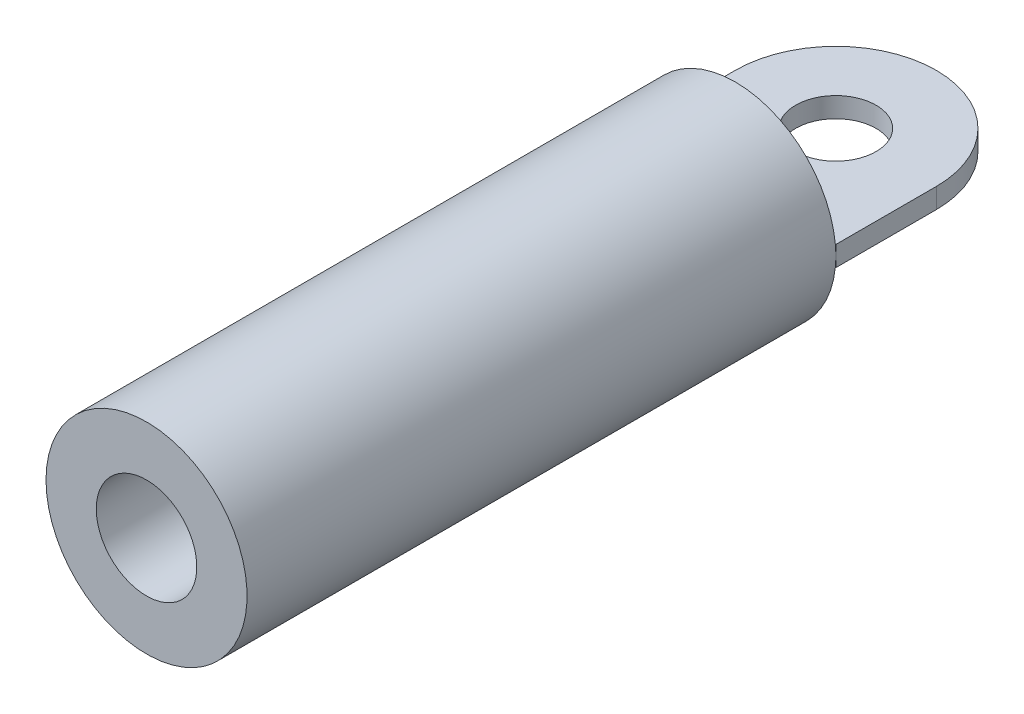
ISO-10303-21;
HEADER;
FILE_DESCRIPTION(('STEP AP214'),'2;1');
FILE_NAME('part.step','',(''),(''),'','','');
FILE_SCHEMA(('AUTOMOTIVE_DESIGN { 1 0 10303 214 1 1 1 1 }'));
ENDSEC;
DATA;
#1=APPLICATION_CONTEXT('core data for automotive mechanical design processes');
#2=APPLICATION_PROTOCOL_DEFINITION('international standard','automotive_design',2000,#1);
#3=PRODUCT_CONTEXT('',#1,'mechanical');
#4=PRODUCT('Part','Part','',(#3));
#5=PRODUCT_RELATED_PRODUCT_CATEGORY('part','',(#4));
#6=PRODUCT_DEFINITION_FORMATION('','',#4);
#7=PRODUCT_DEFINITION_CONTEXT('part definition',#1,'design');
#8=PRODUCT_DEFINITION('design','',#6,#7);
#9=PRODUCT_DEFINITION_SHAPE('','',#8);
#10=(LENGTH_UNIT() NAMED_UNIT(*) SI_UNIT(.MILLI.,.METRE.));
#11=(NAMED_UNIT(*) PLANE_ANGLE_UNIT() SI_UNIT($,.RADIAN.));
#12=(NAMED_UNIT(*) SI_UNIT($,.STERADIAN.) SOLID_ANGLE_UNIT());
#13=UNCERTAINTY_MEASURE_WITH_UNIT(LENGTH_MEASURE(1.E-05),#10,'distance_accuracy_value','');
#14=(GEOMETRIC_REPRESENTATION_CONTEXT(3) GLOBAL_UNCERTAINTY_ASSIGNED_CONTEXT((#13)) GLOBAL_UNIT_ASSIGNED_CONTEXT((#10,
#11,#12)) REPRESENTATION_CONTEXT('',''));
#15=CARTESIAN_POINT('',(0.,0.,0.));
#16=DIRECTION('',(0.,0.,1.));
#17=DIRECTION('',(1.,0.,0.));
#18=AXIS2_PLACEMENT_3D('',#15,#16,#17);
#19=CARTESIAN_POINT('',(0.,0.,3.175));
#20=DIRECTION('',(0.,0.,-1.));
#21=DIRECTION('',(-1.,0.,0.));
#22=AXIS2_PLACEMENT_3D('',#19,#20,#21);
#23=PLANE('',#22);
#24=CARTESIAN_POINT('',(0.,0.,3.175));
#25=DIRECTION('',(0.,0.,-1.));
#26=DIRECTION('',(-1.,0.,0.));
#27=AXIS2_PLACEMENT_3D('',#24,#25,#26);
#28=CIRCLE('',#27,3.175);
#29=CARTESIAN_POINT('',(3.15908511281352,-0.3175,3.175));
#30=VERTEX_POINT('',#29);
#31=CARTESIAN_POINT('',(-3.15908511281352,-0.3175,3.175));
#32=VERTEX_POINT('',#31);
#33=EDGE_CURVE('E211',#30,#32,#28,.T.);
#34=ORIENTED_EDGE('',*,*,#33,.T.);
#35=DIRECTION('',(1.,0.,0.));
#36=VECTOR('',#35,1.);
#37=CARTESIAN_POINT('',(0.,-0.3175,3.175));
#38=LINE('',#37,#36);
#39=CARTESIAN_POINT('',(-1.55542598666732,-0.3175,3.175));
#40=VERTEX_POINT('',#39);
#41=EDGE_CURVE('E231',#32,#40,#38,.T.);
#42=ORIENTED_EDGE('',*,*,#41,.T.);
#43=CARTESIAN_POINT('',(0.,0.,3.175));
#44=DIRECTION('',(0.,0.,-1.));
#45=DIRECTION('',(-1.,0.,0.));
#46=AXIS2_PLACEMENT_3D('',#43,#44,#45);
#47=CIRCLE('',#46,1.5875);
#48=CARTESIAN_POINT('',(1.55542598666732,-0.3175,3.175));
#49=VERTEX_POINT('',#48);
#50=EDGE_CURVE('E208',#49,#40,#47,.T.);
#51=ORIENTED_EDGE('',*,*,#50,.F.);
#52=EDGE_CURVE('E164',#49,#30,#38,.T.);
#53=ORIENTED_EDGE('',*,*,#52,.T.);
#54=EDGE_LOOP('',(#34,#42,#51,#53));
#55=FACE_BOUND('',#54,.T.);
#56=ADVANCED_FACE('F41',(#55),#23,.T.);
#57=CARTESIAN_POINT('',(0.,0.,0.));
#58=DIRECTION('',(0.,0.,-1.));
#59=DIRECTION('',(-1.,0.,0.));
#60=AXIS2_PLACEMENT_3D('',#57,#58,#59);
#61=CYLINDRICAL_SURFACE('',#60,1.5875);
#62=CARTESIAN_POINT('',(-1.55542598666732,0.3175,3.175));
#63=VERTEX_POINT('',#62);
#64=CARTESIAN_POINT('',(1.55542598666732,0.3175,3.175));
#65=VERTEX_POINT('',#64);
#66=EDGE_CURVE('E45',#63,#65,#47,.T.);
#67=ORIENTED_EDGE('',*,*,#66,.T.);
#68=EDGE_CURVE('E481',#65,#49,#47,.T.);
#69=ORIENTED_EDGE('',*,*,#68,.T.);
#70=ORIENTED_EDGE('',*,*,#50,.T.);
#71=EDGE_CURVE('E199',#40,#63,#47,.T.);
#72=ORIENTED_EDGE('',*,*,#71,.T.);
#73=EDGE_LOOP('',(#67,#69,#70,#72));
#74=FACE_BOUND('',#73,.T.);
#75=CARTESIAN_POINT('',(0.,0.,21.769090574));
#76=DIRECTION('',(0.,0.,-1.));
#77=DIRECTION('',(-1.,0.,0.));
#78=AXIS2_PLACEMENT_3D('',#75,#76,#77);
#79=CIRCLE('',#78,1.5875);
#80=CARTESIAN_POINT('',(-1.5875,0.,21.769090574));
#81=VERTEX_POINT('',#80);
#82=EDGE_CURVE('E182',#81,#81,#79,.T.);
#83=ORIENTED_EDGE('',*,*,#82,.F.);
#84=EDGE_LOOP('',(#83));
#85=FACE_BOUND('',#84,.T.);
#86=ADVANCED_FACE('F43',(#74,#85),#61,.F.);
#87=DIRECTION('',(1.,0.,0.));
#88=VECTOR('',#87,1.);
#89=CARTESIAN_POINT('',(0.,0.3175,3.175));
#90=LINE('',#89,#88);
#91=CARTESIAN_POINT('',(-3.15908511281352,0.3175,3.175));
#92=VERTEX_POINT('',#91);
#93=EDGE_CURVE('E11',#92,#63,#90,.T.);
#94=ORIENTED_EDGE('',*,*,#93,.F.);
#95=CARTESIAN_POINT('',(3.15908511281352,0.3175,3.175));
#96=VERTEX_POINT('',#95);
#97=EDGE_CURVE('E200',#92,#96,#28,.T.);
#98=ORIENTED_EDGE('',*,*,#97,.T.);
#99=EDGE_CURVE('E51',#65,#96,#90,.T.);
#100=ORIENTED_EDGE('',*,*,#99,.F.);
#101=ORIENTED_EDGE('',*,*,#66,.F.);
#102=EDGE_LOOP('',(#94,#98,#100,#101));
#103=FACE_BOUND('',#102,.T.);
#104=ADVANCED_FACE('F236',(#103),#23,.T.);
#105=CARTESIAN_POINT('',(0.,0.,0.));
#106=DIRECTION('',(0.,0.,-1.));
#107=DIRECTION('',(-1.,0.,0.));
#108=AXIS2_PLACEMENT_3D('',#105,#106,#107);
#109=CYLINDRICAL_SURFACE('',#108,3.175);
#110=CARTESIAN_POINT('',(0.,0.,21.769090574));
#111=DIRECTION('',(0.,0.,-1.));
#112=DIRECTION('',(-1.,0.,0.));
#113=AXIS2_PLACEMENT_3D('',#110,#111,#112);
#114=CIRCLE('',#113,3.175);
#115=CARTESIAN_POINT('',(-3.175,0.,21.769090574));
#116=VERTEX_POINT('',#115);
#117=EDGE_CURVE('E193',#116,#116,#114,.T.);
#118=ORIENTED_EDGE('',*,*,#117,.T.);
#119=EDGE_LOOP('',(#118));
#120=FACE_BOUND('',#119,.T.);
#121=CARTESIAN_POINT('',(-3.175,0.,3.175));
#122=VERTEX_POINT('',#121);
#123=EDGE_CURVE('E197',#122,#92,#28,.T.);
#124=ORIENTED_EDGE('',*,*,#123,.F.);
#125=EDGE_CURVE('E196',#32,#122,#28,.T.);
#126=ORIENTED_EDGE('',*,*,#125,.F.);
#127=ORIENTED_EDGE('',*,*,#33,.F.);
#128=CARTESIAN_POINT('',(3.175,0.,3.175));
#129=VERTEX_POINT('',#128);
#130=EDGE_CURVE('E216',#129,#30,#28,.T.);
#131=ORIENTED_EDGE('',*,*,#130,.F.);
#132=EDGE_CURVE('E132',#96,#129,#28,.T.);
#133=ORIENTED_EDGE('',*,*,#132,.F.);
#134=ORIENTED_EDGE('',*,*,#97,.F.);
#135=EDGE_LOOP('',(#124,#126,#127,#131,#133,#134));
#136=FACE_BOUND('',#135,.T.);
#137=ADVANCED_FACE('F232',(#120,#136),#109,.T.);
#138=CARTESIAN_POINT('',(0.,0.,21.769090574));
#139=DIRECTION('',(0.,0.,1.));
#140=DIRECTION('',(1.,0.,0.));
#141=AXIS2_PLACEMENT_3D('',#138,#139,#140);
#142=PLANE('',#141);
#143=ORIENTED_EDGE('',*,*,#82,.T.);
#144=EDGE_LOOP('',(#143));
#145=FACE_BOUND('',#144,.T.);
#146=ORIENTED_EDGE('',*,*,#117,.F.);
#147=EDGE_LOOP('',(#146));
#148=FACE_BOUND('',#147,.T.);
#149=ADVANCED_FACE('F259',(#145,#148),#142,.T.);
#150=CARTESIAN_POINT('',(0.,-0.3175,3.175));
#151=DIRECTION('',(0.,0.,1.));
#152=DIRECTION('',(1.,0.,0.));
#153=AXIS2_PLACEMENT_3D('',#150,#151,#152);
#154=PLANE('',#153);
#155=CARTESIAN_POINT('',(3.175,0.3175,3.175));
#156=VERTEX_POINT('',#155);
#157=EDGE_CURVE('E115',#96,#156,#90,.T.);
#158=ORIENTED_EDGE('',*,*,#157,.F.);
#159=ORIENTED_EDGE('',*,*,#132,.T.);
#160=DIRECTION('',(0.,1.,0.));
#161=VECTOR('',#160,1.);
#162=CARTESIAN_POINT('',(3.175,-0.3175,3.175));
#163=LINE('',#162,#161);
#164=EDGE_CURVE('E130',#129,#156,#163,.T.);
#165=ORIENTED_EDGE('',*,*,#164,.T.);
#166=EDGE_LOOP('',(#158,#159,#165));
#167=FACE_BOUND('',#166,.T.);
#168=ADVANCED_FACE('F131',(#167),#154,.T.);
#169=DIRECTION('',(0.,1.,0.));
#170=VECTOR('',#169,1.);
#171=CARTESIAN_POINT('',(-3.175,-0.3175,3.175));
#172=LINE('',#171,#170);
#173=CARTESIAN_POINT('',(-3.175,0.3175,3.175));
#174=VERTEX_POINT('',#173);
#175=EDGE_CURVE('E183',#122,#174,#172,.T.);
#176=ORIENTED_EDGE('',*,*,#175,.F.);
#177=ORIENTED_EDGE('',*,*,#123,.T.);
#178=EDGE_CURVE('E128',#174,#92,#90,.T.);
#179=ORIENTED_EDGE('',*,*,#178,.F.);
#180=EDGE_LOOP('',(#176,#177,#179));
#181=FACE_BOUND('',#180,.T.);
#182=ADVANCED_FACE('F252',(#181),#154,.T.);
#183=ORIENTED_EDGE('',*,*,#68,.F.);
#184=EDGE_CURVE('E53',#63,#65,#90,.T.);
#185=ORIENTED_EDGE('',*,*,#184,.F.);
#186=ORIENTED_EDGE('',*,*,#71,.F.);
#187=EDGE_CURVE('E60',#40,#49,#38,.T.);
#188=ORIENTED_EDGE('',*,*,#187,.T.);
#189=EDGE_LOOP('',(#183,#185,#186,#188));
#190=FACE_BOUND('',#189,.T.);
#191=ADVANCED_FACE('F242',(#190),#154,.T.);
#192=CARTESIAN_POINT('',(3.175,-0.3175,3.175));
#193=VERTEX_POINT('',#192);
#194=EDGE_CURVE('E137',#193,#129,#163,.T.);
#195=ORIENTED_EDGE('',*,*,#194,.T.);
#196=ORIENTED_EDGE('',*,*,#130,.T.);
#197=EDGE_CURVE('E66',#30,#193,#38,.T.);
#198=ORIENTED_EDGE('',*,*,#197,.T.);
#199=EDGE_LOOP('',(#195,#196,#198));
#200=FACE_BOUND('',#199,.T.);
#201=ADVANCED_FACE('F225',(#200),#154,.T.);
#202=CARTESIAN_POINT('',(-3.175,-0.3175,3.175));
#203=VERTEX_POINT('',#202);
#204=EDGE_CURVE('E159',#203,#32,#38,.T.);
#205=ORIENTED_EDGE('',*,*,#204,.T.);
#206=ORIENTED_EDGE('',*,*,#125,.T.);
#207=EDGE_CURVE('E178',#203,#122,#172,.T.);
#208=ORIENTED_EDGE('',*,*,#207,.F.);
#209=EDGE_LOOP('',(#205,#206,#208));
#210=FACE_BOUND('',#209,.T.);
#211=ADVANCED_FACE('F260',(#210),#154,.T.);
#212=CARTESIAN_POINT('',(-3.175,-0.3175,0.));
#213=DIRECTION('',(-1.,0.,0.));
#214=DIRECTION('',(0.,0.,1.));
#215=AXIS2_PLACEMENT_3D('',#212,#213,#214);
#216=PLANE('',#215);
#217=ORIENTED_EDGE('',*,*,#207,.T.);
#218=ORIENTED_EDGE('',*,*,#175,.T.);
#219=DIRECTION('',(0.,0.,1.));
#220=VECTOR('',#219,1.);
#221=CARTESIAN_POINT('',(-3.175,0.3175,0.));
#222=LINE('',#221,#220);
#223=CARTESIAN_POINT('',(-3.175,0.3175,0.));
#224=VERTEX_POINT('',#223);
#225=EDGE_CURVE('E149',#224,#174,#222,.T.);
#226=ORIENTED_EDGE('',*,*,#225,.F.);
#227=DIRECTION('',(0.,1.,0.));
#228=VECTOR('',#227,1.);
#229=CARTESIAN_POINT('',(-3.175,-0.3175,0.));
#230=LINE('',#229,#228);
#231=CARTESIAN_POINT('',(-3.175,-0.3175,0.));
#232=VERTEX_POINT('',#231);
#233=EDGE_CURVE('E184',#232,#224,#230,.T.);
#234=ORIENTED_EDGE('',*,*,#233,.F.);
#235=DIRECTION('',(0.,0.,1.));
#236=VECTOR('',#235,1.);
#237=CARTESIAN_POINT('',(-3.175,-0.3175,0.));
#238=LINE('',#237,#236);
#239=EDGE_CURVE('E171',#232,#203,#238,.T.);
#240=ORIENTED_EDGE('',*,*,#239,.T.);
#241=EDGE_LOOP('',(#217,#218,#226,#234,#240));
#242=FACE_BOUND('',#241,.T.);
#243=ADVANCED_FACE('F251',(#242),#216,.T.);
#244=CARTESIAN_POINT('',(0.,-0.3175,0.));
#245=DIRECTION('',(0.,1.,0.));
#246=DIRECTION('',(0.,0.,1.));
#247=AXIS2_PLACEMENT_3D('',#244,#245,#246);
#248=CYLINDRICAL_SURFACE('',#247,3.175);
#249=ORIENTED_EDGE('',*,*,#233,.T.);
#250=CARTESIAN_POINT('',(0.,0.3175,0.));
#251=DIRECTION('',(0.,1.,0.));
#252=DIRECTION('',(0.,0.,1.));
#253=AXIS2_PLACEMENT_3D('',#250,#251,#252);
#254=CIRCLE('',#253,3.175);
#255=CARTESIAN_POINT('',(3.175,0.3175,0.));
#256=VERTEX_POINT('',#255);
#257=EDGE_CURVE('E145',#256,#224,#254,.T.);
#258=ORIENTED_EDGE('',*,*,#257,.F.);
#259=DIRECTION('',(0.,1.,0.));
#260=VECTOR('',#259,1.);
#261=CARTESIAN_POINT('',(3.175,-0.3175,0.));
#262=LINE('',#261,#260);
#263=CARTESIAN_POINT('',(3.175,-0.3175,0.));
#264=VERTEX_POINT('',#263);
#265=EDGE_CURVE('E142',#264,#256,#262,.T.);
#266=ORIENTED_EDGE('',*,*,#265,.F.);
#267=CARTESIAN_POINT('',(0.,-0.3175,0.));
#268=DIRECTION('',(0.,1.,0.));
#269=DIRECTION('',(0.,0.,1.));
#270=AXIS2_PLACEMENT_3D('',#267,#268,#269);
#271=CIRCLE('',#270,3.175);
#272=EDGE_CURVE('E167',#264,#232,#271,.T.);
#273=ORIENTED_EDGE('',*,*,#272,.T.);
#274=EDGE_LOOP('',(#249,#258,#266,#273));
#275=FACE_BOUND('',#274,.T.);
#276=ADVANCED_FACE('F330',(#275),#248,.T.);
#277=CARTESIAN_POINT('',(3.175,-0.3175,0.));
#278=DIRECTION('',(-1.,0.,0.));
#279=DIRECTION('',(0.,0.,1.));
#280=AXIS2_PLACEMENT_3D('',#277,#278,#279);
#281=PLANE('',#280);
#282=ORIENTED_EDGE('',*,*,#265,.T.);
#283=DIRECTION('',(0.,0.,1.));
#284=VECTOR('',#283,1.);
#285=CARTESIAN_POINT('',(3.175,0.3175,0.));
#286=LINE('',#285,#284);
#287=EDGE_CURVE('E122',#256,#156,#286,.T.);
#288=ORIENTED_EDGE('',*,*,#287,.T.);
#289=ORIENTED_EDGE('',*,*,#164,.F.);
#290=ORIENTED_EDGE('',*,*,#194,.F.);
#291=DIRECTION('',(0.,0.,1.));
#292=VECTOR('',#291,1.);
#293=CARTESIAN_POINT('',(3.175,-0.3175,0.));
#294=LINE('',#293,#292);
#295=EDGE_CURVE('E163',#264,#193,#294,.T.);
#296=ORIENTED_EDGE('',*,*,#295,.F.);
#297=EDGE_LOOP('',(#282,#288,#289,#290,#296));
#298=FACE_BOUND('',#297,.T.);
#299=ADVANCED_FACE('F140',(#298),#281,.F.);
#300=CARTESIAN_POINT('',(0.,-0.3175,0.));
#301=DIRECTION('',(0.,1.,0.));
#302=DIRECTION('',(0.,0.,1.));
#303=AXIS2_PLACEMENT_3D('',#300,#301,#302);
#304=CYLINDRICAL_SURFACE('',#303,1.27);
#305=CARTESIAN_POINT('',(0.,-0.3175,0.));
#306=DIRECTION('',(0.,1.,0.));
#307=DIRECTION('',(0.,0.,1.));
#308=AXIS2_PLACEMENT_3D('',#305,#306,#307);
#309=CIRCLE('',#308,1.27);
#310=CARTESIAN_POINT('',(0.,-0.3175,1.27));
#311=VERTEX_POINT('',#310);
#312=EDGE_CURVE('E138',#311,#311,#309,.T.);
#313=ORIENTED_EDGE('',*,*,#312,.F.);
#314=EDGE_LOOP('',(#313));
#315=FACE_BOUND('',#314,.T.);
#316=CARTESIAN_POINT('',(0.,0.3175,0.));
#317=DIRECTION('',(0.,1.,0.));
#318=DIRECTION('',(0.,0.,1.));
#319=AXIS2_PLACEMENT_3D('',#316,#317,#318);
#320=CIRCLE('',#319,1.27);
#321=CARTESIAN_POINT('',(0.,0.3175,1.27));
#322=VERTEX_POINT('',#321);
#323=EDGE_CURVE('E155',#322,#322,#320,.T.);
#324=ORIENTED_EDGE('',*,*,#323,.T.);
#325=EDGE_LOOP('',(#324));
#326=FACE_BOUND('',#325,.T.);
#327=ADVANCED_FACE('F349',(#315,#326),#304,.F.);
#328=CARTESIAN_POINT('',(0.,-0.3175,0.));
#329=DIRECTION('',(0.,1.,0.));
#330=DIRECTION('',(0.,0.,1.));
#331=AXIS2_PLACEMENT_3D('',#328,#329,#330);
#332=PLANE('',#331);
#333=ORIENTED_EDGE('',*,*,#204,.F.);
#334=ORIENTED_EDGE('',*,*,#239,.F.);
#335=ORIENTED_EDGE('',*,*,#272,.F.);
#336=ORIENTED_EDGE('',*,*,#295,.T.);
#337=ORIENTED_EDGE('',*,*,#197,.F.);
#338=ORIENTED_EDGE('',*,*,#52,.F.);
#339=ORIENTED_EDGE('',*,*,#187,.F.);
#340=ORIENTED_EDGE('',*,*,#41,.F.);
#341=EDGE_LOOP('',(#333,#334,#335,#336,#337,#338,#339,#340));
#342=FACE_BOUND('',#341,.T.);
#343=ORIENTED_EDGE('',*,*,#312,.T.);
#344=EDGE_LOOP('',(#343));
#345=FACE_BOUND('',#344,.T.);
#346=ADVANCED_FACE('F357',(#342,#345),#332,.F.);
#347=CARTESIAN_POINT('',(0.,0.3175,0.));
#348=DIRECTION('',(0.,1.,0.));
#349=DIRECTION('',(0.,0.,1.));
#350=AXIS2_PLACEMENT_3D('',#347,#348,#349);
#351=PLANE('',#350);
#352=ORIENTED_EDGE('',*,*,#178,.T.);
#353=ORIENTED_EDGE('',*,*,#93,.T.);
#354=ORIENTED_EDGE('',*,*,#184,.T.);
#355=ORIENTED_EDGE('',*,*,#99,.T.);
#356=ORIENTED_EDGE('',*,*,#157,.T.);
#357=ORIENTED_EDGE('',*,*,#287,.F.);
#358=ORIENTED_EDGE('',*,*,#257,.T.);
#359=ORIENTED_EDGE('',*,*,#225,.T.);
#360=EDGE_LOOP('',(#352,#353,#354,#355,#356,#357,#358,#359));
#361=FACE_BOUND('',#360,.T.);
#362=ORIENTED_EDGE('',*,*,#323,.F.);
#363=EDGE_LOOP('',(#362));
#364=FACE_BOUND('',#363,.T.);
#365=ADVANCED_FACE('F118',(#361,#364),#351,.T.);
#366=CLOSED_SHELL('',(#56,#86,#104,#137,#149,#168,#182,#191,#201,#211,#243,#276,#299,#327,#346,#365));
#367=MANIFOLD_SOLID_BREP('B2',#366);
#368=ADVANCED_BREP_SHAPE_REPRESENTATION('',(#18,#367),#14);
#369=SHAPE_DEFINITION_REPRESENTATION(#9,#368);
ENDSEC;
END-ISO-10303-21;
